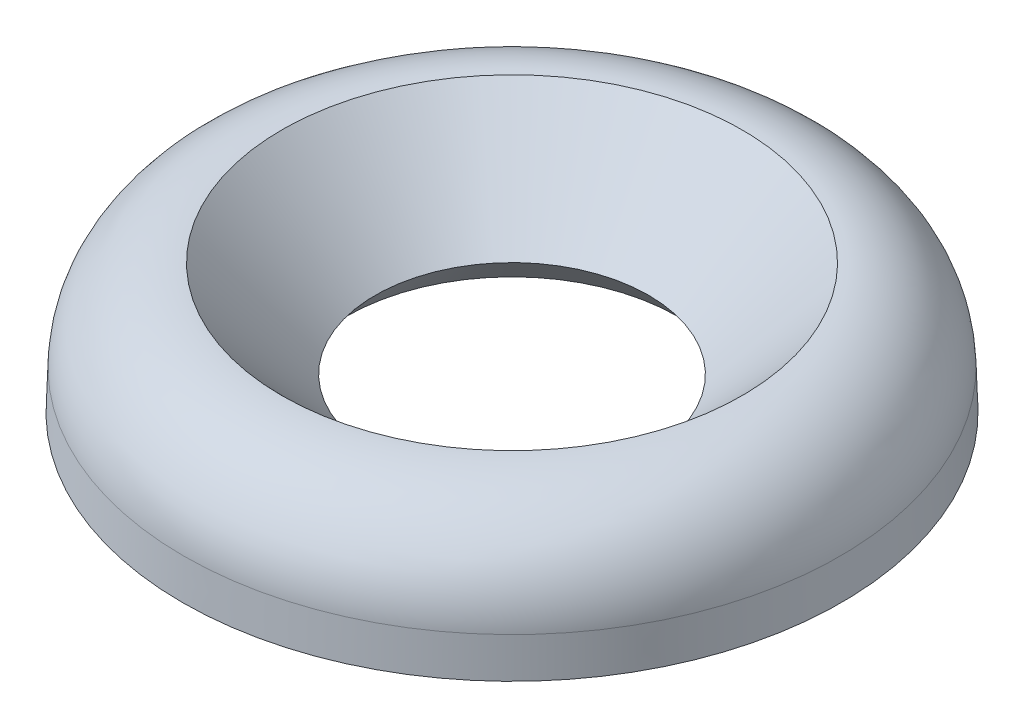
ISO-10303-21;
HEADER;
FILE_DESCRIPTION(('STEP AP214'),'2;1');
FILE_NAME('part.step','',(''),(''),'','','');
FILE_SCHEMA(('AUTOMOTIVE_DESIGN { 1 0 10303 214 1 1 1 1 }'));
ENDSEC;
DATA;
#1=APPLICATION_CONTEXT('core data for automotive mechanical design processes');
#2=APPLICATION_PROTOCOL_DEFINITION('international standard','automotive_design',2000,#1);
#3=PRODUCT_CONTEXT('',#1,'mechanical');
#4=PRODUCT('Part','Part','',(#3));
#5=PRODUCT_RELATED_PRODUCT_CATEGORY('part','',(#4));
#6=PRODUCT_DEFINITION_FORMATION('','',#4);
#7=PRODUCT_DEFINITION_CONTEXT('part definition',#1,'design');
#8=PRODUCT_DEFINITION('design','',#6,#7);
#9=PRODUCT_DEFINITION_SHAPE('','',#8);
#10=(LENGTH_UNIT() NAMED_UNIT(*) SI_UNIT(.MILLI.,.METRE.));
#11=(NAMED_UNIT(*) PLANE_ANGLE_UNIT() SI_UNIT($,.RADIAN.));
#12=(NAMED_UNIT(*) SI_UNIT($,.STERADIAN.) SOLID_ANGLE_UNIT());
#13=UNCERTAINTY_MEASURE_WITH_UNIT(LENGTH_MEASURE(1.E-05),#10,'distance_accuracy_value','');
#14=(GEOMETRIC_REPRESENTATION_CONTEXT(3) GLOBAL_UNCERTAINTY_ASSIGNED_CONTEXT((#13)) GLOBAL_UNIT_ASSIGNED_CONTEXT((#10,
#11,#12)) REPRESENTATION_CONTEXT('',''));
#15=CARTESIAN_POINT('',(0.,0.,0.));
#16=DIRECTION('',(0.,0.,1.));
#17=DIRECTION('',(1.,0.,0.));
#18=AXIS2_PLACEMENT_3D('',#15,#16,#17);
#19=CARTESIAN_POINT('',(-12.7,0.,0.));
#20=DIRECTION('',(0.,-1.,0.));
#21=DIRECTION('',(0.,0.,-1.));
#22=AXIS2_PLACEMENT_3D('',#19,#20,#21);
#23=PLANE('',#22);
#24=CARTESIAN_POINT('',(0.,0.,0.));
#25=DIRECTION('',(0.,1.,0.));
#26=DIRECTION('',(0.,0.,1.));
#27=AXIS2_PLACEMENT_3D('',#24,#25,#26);
#28=CIRCLE('',#27,6.3924276169265);
#29=CARTESIAN_POINT('',(0.,0.,6.3924276169265));
#30=VERTEX_POINT('',#29);
#31=EDGE_CURVE('E50',#30,#30,#28,.T.);
#32=ORIENTED_EDGE('',*,*,#31,.T.);
#33=EDGE_LOOP('',(#32));
#34=FACE_BOUND('',#33,.T.);
#35=CARTESIAN_POINT('',(0.,0.,0.));
#36=DIRECTION('',(0.,1.,0.));
#37=DIRECTION('',(0.,0.,1.));
#38=AXIS2_PLACEMENT_3D('',#35,#36,#37);
#39=CIRCLE('',#38,12.7);
#40=CARTESIAN_POINT('',(0.,0.,12.7));
#41=VERTEX_POINT('',#40);
#42=EDGE_CURVE('E10',#41,#41,#39,.T.);
#43=ORIENTED_EDGE('',*,*,#42,.F.);
#44=EDGE_LOOP('',(#43));
#45=FACE_BOUND('',#44,.T.);
#46=ADVANCED_FACE('F31',(#34,#45),#23,.T.);
#47=CARTESIAN_POINT('',(0.,1.5230716203771,0.));
#48=DIRECTION('',(0.,-1.,0.));
#49=DIRECTION('',(0.,0.,-1.));
#50=AXIS2_PLACEMENT_3D('',#47,#48,#49);
#51=CONICAL_SURFACE('',#50,12.6468131670254,0.034906585039882);
#52=ORIENTED_EDGE('',*,*,#42,.T.);
#53=EDGE_LOOP('',(#52));
#54=FACE_BOUND('',#53,.T.);
#55=CARTESIAN_POINT('',(0.,1.5230716203771,0.));
#56=DIRECTION('',(0.,1.,0.));
#57=DIRECTION('',(0.,0.,1.));
#58=AXIS2_PLACEMENT_3D('',#55,#56,#57);
#59=CIRCLE('',#58,12.6468131670254);
#60=CARTESIAN_POINT('',(0.,1.5230716203771,12.6468131670254));
#61=VERTEX_POINT('',#60);
#62=EDGE_CURVE('E37',#61,#61,#59,.T.);
#63=ORIENTED_EDGE('',*,*,#62,.F.);
#64=EDGE_LOOP('',(#63));
#65=FACE_BOUND('',#64,.T.);
#66=ADVANCED_FACE('F68',(#54,#65),#51,.T.);
#67=CARTESIAN_POINT('',(0.,1.39749963130061,0.));
#68=DIRECTION('',(0.,1.,0.));
#69=DIRECTION('',(0.,0.,1.));
#70=AXIS2_PLACEMENT_3D('',#67,#68,#69);
#71=TOROIDAL_SURFACE('',#70,9.05090188259084,3.59810315165705);
#72=ORIENTED_EDGE('',*,*,#62,.T.);
#73=EDGE_LOOP('',(#72));
#74=FACE_BOUND('',#73,.T.);
#75=CARTESIAN_POINT('',(0.,4.9911,0.));
#76=DIRECTION('',(0.,1.,0.));
#77=DIRECTION('',(0.,0.,1.));
#78=AXIS2_PLACEMENT_3D('',#75,#76,#77);
#79=CIRCLE('',#78,8.87095);
#80=CARTESIAN_POINT('',(0.,4.9911,8.87095));
#81=VERTEX_POINT('',#80);
#82=EDGE_CURVE('E41',#81,#81,#79,.T.);
#83=ORIENTED_EDGE('',*,*,#82,.F.);
#84=EDGE_LOOP('',(#83));
#85=FACE_BOUND('',#84,.T.);
#86=ADVANCED_FACE('F64',(#74,#85),#71,.T.);
#87=CARTESIAN_POINT('',(0.,1.27,0.));
#88=DIRECTION('',(0.,1.,0.));
#89=DIRECTION('',(0.,0.,1.));
#90=AXIS2_PLACEMENT_3D('',#87,#88,#89);
#91=CONICAL_SURFACE('',#90,5.2705,0.768920903667771);
#92=ORIENTED_EDGE('',*,*,#82,.T.);
#93=EDGE_LOOP('',(#92));
#94=FACE_BOUND('',#93,.T.);
#95=CARTESIAN_POINT('',(0.,1.27,0.));
#96=DIRECTION('',(0.,1.,0.));
#97=DIRECTION('',(0.,0.,1.));
#98=AXIS2_PLACEMENT_3D('',#95,#96,#97);
#99=CIRCLE('',#98,5.2705);
#100=CARTESIAN_POINT('',(0.,1.27,5.2705));
#101=VERTEX_POINT('',#100);
#102=EDGE_CURVE('E45',#101,#101,#99,.T.);
#103=ORIENTED_EDGE('',*,*,#102,.F.);
#104=EDGE_LOOP('',(#103));
#105=FACE_BOUND('',#104,.T.);
#106=ADVANCED_FACE('F58',(#94,#105),#91,.F.);
#107=CARTESIAN_POINT('',(0.,0.,0.));
#108=DIRECTION('',(0.,-1.,0.));
#109=DIRECTION('',(0.,0.,-1.));
#110=AXIS2_PLACEMENT_3D('',#107,#108,#109);
#111=CONICAL_SURFACE('',#110,6.3924276169265,0.723572016820715);
#112=ORIENTED_EDGE('',*,*,#102,.T.);
#113=EDGE_LOOP('',(#112));
#114=FACE_BOUND('',#113,.T.);
#115=ORIENTED_EDGE('',*,*,#31,.F.);
#116=EDGE_LOOP('',(#115));
#117=FACE_BOUND('',#116,.T.);
#118=ADVANCED_FACE('F56',(#114,#117),#111,.F.);
#119=CLOSED_SHELL('',(#46,#66,#86,#106,#118));
#120=MANIFOLD_SOLID_BREP('B2',#119);
#121=ADVANCED_BREP_SHAPE_REPRESENTATION('',(#18,#120),#14);
#122=SHAPE_DEFINITION_REPRESENTATION(#9,#121);
ENDSEC;
END-ISO-10303-21;
